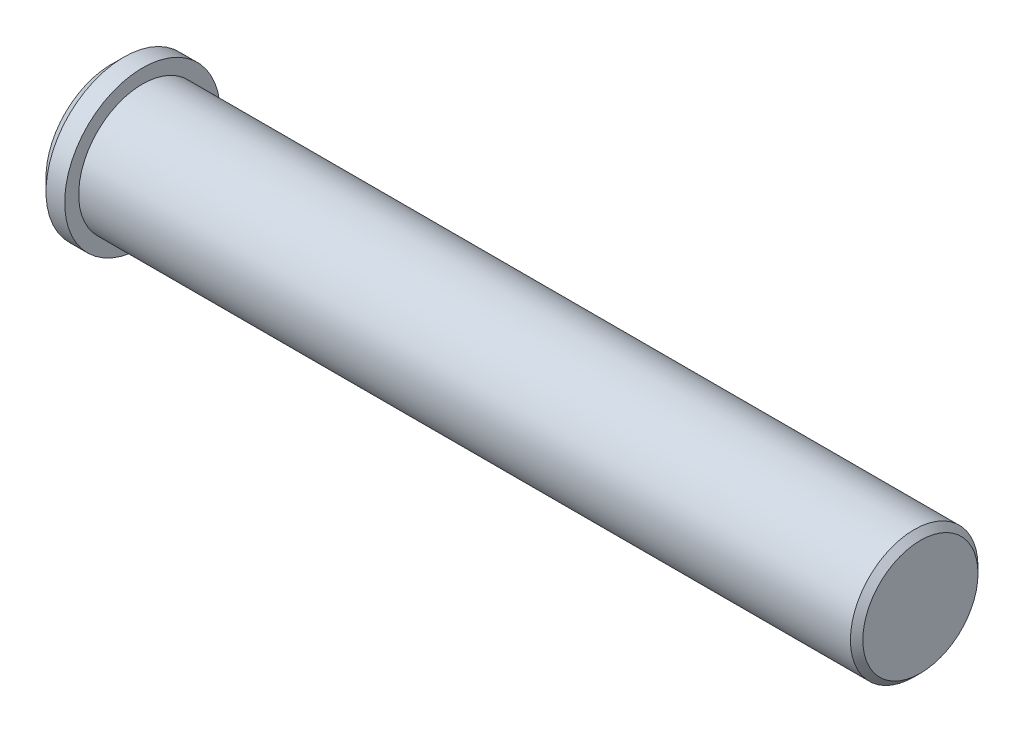
ISO-10303-21;
HEADER;
FILE_DESCRIPTION(('STEP AP214'),'2;1');
FILE_NAME('part.step','',(''),(''),'','','');
FILE_SCHEMA(('AUTOMOTIVE_DESIGN { 1 0 10303 214 1 1 1 1 }'));
ENDSEC;
DATA;
#1=APPLICATION_CONTEXT('core data for automotive mechanical design processes');
#2=APPLICATION_PROTOCOL_DEFINITION('international standard','automotive_design',2000,#1);
#3=PRODUCT_CONTEXT('',#1,'mechanical');
#4=PRODUCT('Part','Part','',(#3));
#5=PRODUCT_RELATED_PRODUCT_CATEGORY('part','',(#4));
#6=PRODUCT_DEFINITION_FORMATION('','',#4);
#7=PRODUCT_DEFINITION_CONTEXT('part definition',#1,'design');
#8=PRODUCT_DEFINITION('design','',#6,#7);
#9=PRODUCT_DEFINITION_SHAPE('','',#8);
#10=(LENGTH_UNIT() NAMED_UNIT(*) SI_UNIT(.MILLI.,.METRE.));
#11=(NAMED_UNIT(*) PLANE_ANGLE_UNIT() SI_UNIT($,.RADIAN.));
#12=(NAMED_UNIT(*) SI_UNIT($,.STERADIAN.) SOLID_ANGLE_UNIT());
#13=UNCERTAINTY_MEASURE_WITH_UNIT(LENGTH_MEASURE(1.E-05),#10,'distance_accuracy_value','');
#14=(GEOMETRIC_REPRESENTATION_CONTEXT(3) GLOBAL_UNCERTAINTY_ASSIGNED_CONTEXT((#13)) GLOBAL_UNIT_ASSIGNED_CONTEXT((#10,
#11,#12)) REPRESENTATION_CONTEXT('',''));
#15=CARTESIAN_POINT('',(0.,0.,0.));
#16=DIRECTION('',(0.,0.,1.));
#17=DIRECTION('',(1.,0.,0.));
#18=AXIS2_PLACEMENT_3D('',#15,#16,#17);
#19=CARTESIAN_POINT('',(-65.,0.,0.));
#20=DIRECTION('',(1.,0.,0.));
#21=DIRECTION('',(0.,0.,-1.));
#22=AXIS2_PLACEMENT_3D('',#19,#20,#21);
#23=PLANE('',#22);
#24=CARTESIAN_POINT('',(-65.,0.,0.));
#25=DIRECTION('',(1.,0.,0.));
#26=DIRECTION('',(0.,0.,-1.));
#27=AXIS2_PLACEMENT_3D('',#24,#25,#26);
#28=CIRCLE('',#27,10.4999383225378);
#29=CARTESIAN_POINT('',(-65.,0.,-10.4999383225377));
#30=VERTEX_POINT('',#29);
#31=EDGE_CURVE('E18',#30,#30,#28,.T.);
#32=ORIENTED_EDGE('',*,*,#31,.F.);
#33=EDGE_LOOP('',(#32));
#34=FACE_BOUND('',#33,.T.);
#35=ADVANCED_FACE('F15',(#34),#23,.F.);
#36=CARTESIAN_POINT('',(-62.9999632872313,0.,0.));
#37=DIRECTION('',(1.,0.,0.));
#38=DIRECTION('',(0.,0.,-1.));
#39=AXIS2_PLACEMENT_3D('',#36,#37,#38);
#40=CONICAL_SURFACE('',#39,12.4999632870156,0.78539522637);
#41=CARTESIAN_POINT('',(-62.9999265740312,0.,0.));
#42=DIRECTION('',(1.,0.,0.));
#43=DIRECTION('',(0.,0.,-1.));
#44=AXIS2_PLACEMENT_3D('',#41,#42,#43);
#45=CIRCLE('',#44,12.5);
#46=CARTESIAN_POINT('',(-62.9999265740312,0.,-12.5));
#47=VERTEX_POINT('',#46);
#48=EDGE_CURVE('E34',#47,#47,#45,.T.);
#49=ORIENTED_EDGE('',*,*,#48,.F.);
#50=EDGE_LOOP('',(#49));
#51=FACE_BOUND('',#50,.T.);
#52=ORIENTED_EDGE('',*,*,#31,.T.);
#53=EDGE_LOOP('',(#52));
#54=FACE_BOUND('',#53,.T.);
#55=ADVANCED_FACE('F41',(#51,#54),#40,.T.);
#56=CARTESIAN_POINT('',(-71.5,0.,0.));
#57=DIRECTION('',(1.,0.,0.));
#58=DIRECTION('',(0.,0.,-1.));
#59=AXIS2_PLACEMENT_3D('',#56,#57,#58);
#60=CYLINDRICAL_SURFACE('',#59,12.5);
#61=CARTESIAN_POINT('',(-60.,0.,0.));
#62=DIRECTION('',(1.,0.,0.));
#63=DIRECTION('',(0.,0.,-1.));
#64=AXIS2_PLACEMENT_3D('',#61,#62,#63);
#65=CIRCLE('',#64,12.5);
#66=CARTESIAN_POINT('',(-60.,0.,-12.5));
#67=VERTEX_POINT('',#66);
#68=EDGE_CURVE('E32',#67,#67,#65,.T.);
#69=ORIENTED_EDGE('',*,*,#68,.F.);
#70=EDGE_LOOP('',(#69));
#71=FACE_BOUND('',#70,.T.);
#72=ORIENTED_EDGE('',*,*,#48,.T.);
#73=EDGE_LOOP('',(#72));
#74=FACE_BOUND('',#73,.T.);
#75=ADVANCED_FACE('F48',(#71,#74),#60,.T.);
#76=CARTESIAN_POINT('',(65.,0.,0.));
#77=DIRECTION('',(1.,0.,0.));
#78=DIRECTION('',(0.,0.,-1.));
#79=AXIS2_PLACEMENT_3D('',#76,#77,#78);
#80=PLANE('',#79);
#81=CARTESIAN_POINT('',(65.,0.,0.));
#82=DIRECTION('',(1.,0.,0.));
#83=DIRECTION('',(0.,0.,-1.));
#84=AXIS2_PLACEMENT_3D('',#81,#82,#83);
#85=CIRCLE('',#84,9.24986264870925);
#86=CARTESIAN_POINT('',(65.,0.,-9.24986264870926));
#87=VERTEX_POINT('',#86);
#88=EDGE_CURVE('E27',#87,#87,#85,.F.);
#89=ORIENTED_EDGE('',*,*,#88,.F.);
#90=EDGE_LOOP('',(#89));
#91=FACE_BOUND('',#90,.T.);
#92=ADVANCED_FACE('F64',(#91),#80,.T.);
#93=CARTESIAN_POINT('',(-60.,0.,0.));
#94=DIRECTION('',(1.,0.,0.));
#95=DIRECTION('',(0.,0.,-1.));
#96=AXIS2_PLACEMENT_3D('',#93,#94,#95);
#97=PLANE('',#96);
#98=CARTESIAN_POINT('',(-60.,0.,0.));
#99=DIRECTION('',(1.,0.,0.));
#100=DIRECTION('',(0.,0.,-1.));
#101=AXIS2_PLACEMENT_3D('',#98,#99,#100);
#102=CIRCLE('',#101,10.25);
#103=CARTESIAN_POINT('',(-60.,0.,-10.25));
#104=VERTEX_POINT('',#103);
#105=EDGE_CURVE('E22',#104,#104,#102,.T.);
#106=ORIENTED_EDGE('',*,*,#105,.F.);
#107=EDGE_LOOP('',(#106));
#108=FACE_BOUND('',#107,.T.);
#109=ORIENTED_EDGE('',*,*,#68,.T.);
#110=EDGE_LOOP('',(#109));
#111=FACE_BOUND('',#110,.T.);
#112=ADVANCED_FACE('F58',(#108,#111),#97,.T.);
#113=CARTESIAN_POINT('',(63.9999238999583,0.,0.));
#114=DIRECTION('',(-1.,0.,0.));
#115=DIRECTION('',(0.,0.,1.));
#116=AXIS2_PLACEMENT_3D('',#113,#114,#115);
#117=CONICAL_SURFACE('',#116,10.2499238988283,0.785390738946);
#118=ORIENTED_EDGE('',*,*,#88,.T.);
#119=EDGE_LOOP('',(#118));
#120=FACE_BOUND('',#119,.T.);
#121=CARTESIAN_POINT('',(63.9998477976566,0.,0.));
#122=DIRECTION('',(-1.,0.,0.));
#123=DIRECTION('',(0.,0.,1.));
#124=AXIS2_PLACEMENT_3D('',#121,#122,#123);
#125=CIRCLE('',#124,10.25);
#126=CARTESIAN_POINT('',(63.9998477976566,0.,10.25));
#127=VERTEX_POINT('',#126);
#128=EDGE_CURVE('E10',#127,#127,#125,.T.);
#129=ORIENTED_EDGE('',*,*,#128,.F.);
#130=EDGE_LOOP('',(#129));
#131=FACE_BOUND('',#130,.T.);
#132=ADVANCED_FACE('F52',(#120,#131),#117,.T.);
#133=CARTESIAN_POINT('',(-71.5,0.,0.));
#134=DIRECTION('',(1.,0.,0.));
#135=DIRECTION('',(0.,0.,-1.));
#136=AXIS2_PLACEMENT_3D('',#133,#134,#135);
#137=CYLINDRICAL_SURFACE('',#136,10.25);
#138=ORIENTED_EDGE('',*,*,#105,.T.);
#139=EDGE_LOOP('',(#138));
#140=FACE_BOUND('',#139,.T.);
#141=ORIENTED_EDGE('',*,*,#128,.T.);
#142=EDGE_LOOP('',(#141));
#143=FACE_BOUND('',#142,.T.);
#144=ADVANCED_FACE('F50',(#140,#143),#137,.T.);
#145=CLOSED_SHELL('',(#35,#55,#75,#92,#112,#132,#144));
#146=MANIFOLD_SOLID_BREP('B1',#145);
#147=ADVANCED_BREP_SHAPE_REPRESENTATION('',(#18,#146),#14);
#148=SHAPE_DEFINITION_REPRESENTATION(#9,#147);
ENDSEC;
END-ISO-10303-21;
